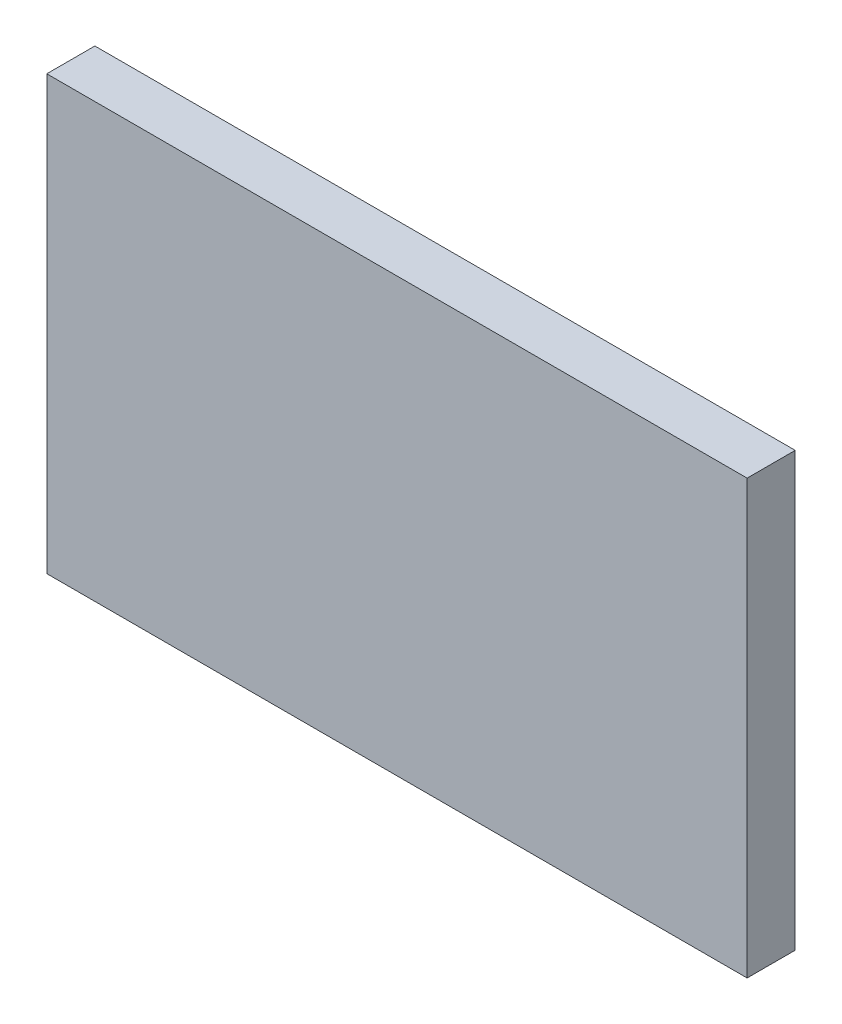
ISO-10303-21;
HEADER;
FILE_DESCRIPTION(('STEP AP214'),'2;1');
FILE_NAME('part.step','',(''),(''),'','','');
FILE_SCHEMA(('AUTOMOTIVE_DESIGN { 1 0 10303 214 1 1 1 1 }'));
ENDSEC;
DATA;
#1=APPLICATION_CONTEXT('core data for automotive mechanical design processes');
#2=APPLICATION_PROTOCOL_DEFINITION('international standard','automotive_design',2000,#1);
#3=PRODUCT_CONTEXT('',#1,'mechanical');
#4=PRODUCT('Part','Part','',(#3));
#5=PRODUCT_RELATED_PRODUCT_CATEGORY('part','',(#4));
#6=PRODUCT_DEFINITION_FORMATION('','',#4);
#7=PRODUCT_DEFINITION_CONTEXT('part definition',#1,'design');
#8=PRODUCT_DEFINITION('design','',#6,#7);
#9=PRODUCT_DEFINITION_SHAPE('','',#8);
#10=(LENGTH_UNIT() NAMED_UNIT(*) SI_UNIT(.MILLI.,.METRE.));
#11=(NAMED_UNIT(*) PLANE_ANGLE_UNIT() SI_UNIT($,.RADIAN.));
#12=(NAMED_UNIT(*) SI_UNIT($,.STERADIAN.) SOLID_ANGLE_UNIT());
#13=UNCERTAINTY_MEASURE_WITH_UNIT(LENGTH_MEASURE(1.E-05),#10,'distance_accuracy_value','');
#14=(GEOMETRIC_REPRESENTATION_CONTEXT(3) GLOBAL_UNCERTAINTY_ASSIGNED_CONTEXT((#13)) GLOBAL_UNIT_ASSIGNED_CONTEXT((#10,
#11,#12)) REPRESENTATION_CONTEXT('',''));
#15=CARTESIAN_POINT('',(0.,0.,0.));
#16=DIRECTION('',(0.,0.,1.));
#17=DIRECTION('',(1.,0.,0.));
#18=AXIS2_PLACEMENT_3D('',#15,#16,#17);
#19=CARTESIAN_POINT('',(23.114,-14.2875,3.175));
#20=DIRECTION('',(-1.,0.,0.));
#21=DIRECTION('',(0.,0.,1.));
#22=AXIS2_PLACEMENT_3D('',#19,#20,#21);
#23=PLANE('',#22);
#24=DIRECTION('',(0.,1.,0.));
#25=VECTOR('',#24,1.);
#26=CARTESIAN_POINT('',(23.114,-14.2875,0.));
#27=LINE('',#26,#25);
#28=CARTESIAN_POINT('',(23.114,-14.2875,0.));
#29=VERTEX_POINT('',#28);
#30=CARTESIAN_POINT('',(23.114,14.2875,0.));
#31=VERTEX_POINT('',#30);
#32=EDGE_CURVE('E98',#29,#31,#27,.T.);
#33=ORIENTED_EDGE('',*,*,#32,.T.);
#34=DIRECTION('',(0.,0.,-1.));
#35=VECTOR('',#34,1.);
#36=CARTESIAN_POINT('',(23.114,14.2875,3.175));
#37=LINE('',#36,#35);
#38=CARTESIAN_POINT('',(23.114,14.2875,3.175));
#39=VERTEX_POINT('',#38);
#40=EDGE_CURVE('E11',#39,#31,#37,.T.);
#41=ORIENTED_EDGE('',*,*,#40,.F.);
#42=DIRECTION('',(0.,1.,0.));
#43=VECTOR('',#42,1.);
#44=CARTESIAN_POINT('',(23.114,-14.2875,3.175));
#45=LINE('',#44,#43);
#46=CARTESIAN_POINT('',(23.114,-14.2875,3.175));
#47=VERTEX_POINT('',#46);
#48=EDGE_CURVE('E86',#47,#39,#45,.T.);
#49=ORIENTED_EDGE('',*,*,#48,.F.);
#50=DIRECTION('',(0.,0.,-1.));
#51=VECTOR('',#50,1.);
#52=CARTESIAN_POINT('',(23.114,-14.2875,3.175));
#53=LINE('',#52,#51);
#54=EDGE_CURVE('E94',#47,#29,#53,.T.);
#55=ORIENTED_EDGE('',*,*,#54,.T.);
#56=EDGE_LOOP('',(#33,#41,#49,#55));
#57=FACE_BOUND('',#56,.T.);
#58=ADVANCED_FACE('F35',(#57),#23,.F.);
#59=CARTESIAN_POINT('',(-23.114,14.2875,3.175));
#60=DIRECTION('',(0.,-1.,0.));
#61=DIRECTION('',(0.,0.,-1.));
#62=AXIS2_PLACEMENT_3D('',#59,#60,#61);
#63=PLANE('',#62);
#64=DIRECTION('',(-1.,0.,0.));
#65=VECTOR('',#64,1.);
#66=CARTESIAN_POINT('',(-23.114,14.2875,0.));
#67=LINE('',#66,#65);
#68=CARTESIAN_POINT('',(-23.114,14.2875,0.));
#69=VERTEX_POINT('',#68);
#70=EDGE_CURVE('E90',#31,#69,#67,.T.);
#71=ORIENTED_EDGE('',*,*,#70,.T.);
#72=DIRECTION('',(0.,0.,-1.));
#73=VECTOR('',#72,1.);
#74=CARTESIAN_POINT('',(-23.114,14.2875,3.175));
#75=LINE('',#74,#73);
#76=CARTESIAN_POINT('',(-23.114,14.2875,3.175));
#77=VERTEX_POINT('',#76);
#78=EDGE_CURVE('E43',#77,#69,#75,.T.);
#79=ORIENTED_EDGE('',*,*,#78,.F.);
#80=DIRECTION('',(-1.,0.,0.));
#81=VECTOR('',#80,1.);
#82=CARTESIAN_POINT('',(-23.114,14.2875,3.175));
#83=LINE('',#82,#81);
#84=EDGE_CURVE('E81',#39,#77,#83,.T.);
#85=ORIENTED_EDGE('',*,*,#84,.F.);
#86=ORIENTED_EDGE('',*,*,#40,.T.);
#87=EDGE_LOOP('',(#71,#79,#85,#86));
#88=FACE_BOUND('',#87,.T.);
#89=ADVANCED_FACE('F89',(#88),#63,.F.);
#90=CARTESIAN_POINT('',(-23.114,-14.2875,3.175));
#91=DIRECTION('',(1.,0.,0.));
#92=DIRECTION('',(0.,0.,-1.));
#93=AXIS2_PLACEMENT_3D('',#90,#91,#92);
#94=PLANE('',#93);
#95=DIRECTION('',(0.,-1.,0.));
#96=VECTOR('',#95,1.);
#97=CARTESIAN_POINT('',(-23.114,-14.2875,0.));
#98=LINE('',#97,#96);
#99=CARTESIAN_POINT('',(-23.114,-14.2875,0.));
#100=VERTEX_POINT('',#99);
#101=EDGE_CURVE('E68',#69,#100,#98,.T.);
#102=ORIENTED_EDGE('',*,*,#101,.T.);
#103=DIRECTION('',(0.,0.,-1.));
#104=VECTOR('',#103,1.);
#105=CARTESIAN_POINT('',(-23.114,-14.2875,3.175));
#106=LINE('',#105,#104);
#107=CARTESIAN_POINT('',(-23.114,-14.2875,3.175));
#108=VERTEX_POINT('',#107);
#109=EDGE_CURVE('E91',#108,#100,#106,.T.);
#110=ORIENTED_EDGE('',*,*,#109,.F.);
#111=DIRECTION('',(0.,-1.,0.));
#112=VECTOR('',#111,1.);
#113=CARTESIAN_POINT('',(-23.114,-14.2875,3.175));
#114=LINE('',#113,#112);
#115=EDGE_CURVE('E84',#77,#108,#114,.T.);
#116=ORIENTED_EDGE('',*,*,#115,.F.);
#117=ORIENTED_EDGE('',*,*,#78,.T.);
#118=EDGE_LOOP('',(#102,#110,#116,#117));
#119=FACE_BOUND('',#118,.T.);
#120=ADVANCED_FACE('F92',(#119),#94,.F.);
#121=CARTESIAN_POINT('',(-23.114,-14.2875,3.175));
#122=DIRECTION('',(0.,1.,0.));
#123=DIRECTION('',(0.,0.,1.));
#124=AXIS2_PLACEMENT_3D('',#121,#122,#123);
#125=PLANE('',#124);
#126=DIRECTION('',(1.,0.,0.));
#127=VECTOR('',#126,1.);
#128=CARTESIAN_POINT('',(-23.114,-14.2875,0.));
#129=LINE('',#128,#127);
#130=EDGE_CURVE('E74',#100,#29,#129,.T.);
#131=ORIENTED_EDGE('',*,*,#130,.T.);
#132=ORIENTED_EDGE('',*,*,#54,.F.);
#133=DIRECTION('',(1.,0.,0.));
#134=VECTOR('',#133,1.);
#135=CARTESIAN_POINT('',(-23.114,-14.2875,3.175));
#136=LINE('',#135,#134);
#137=EDGE_CURVE('E51',#108,#47,#136,.T.);
#138=ORIENTED_EDGE('',*,*,#137,.F.);
#139=ORIENTED_EDGE('',*,*,#109,.T.);
#140=EDGE_LOOP('',(#131,#132,#138,#139));
#141=FACE_BOUND('',#140,.T.);
#142=ADVANCED_FACE('F105',(#141),#125,.F.);
#143=CARTESIAN_POINT('',(0.,0.,3.175));
#144=DIRECTION('',(0.,0.,-1.));
#145=DIRECTION('',(-1.,0.,0.));
#146=AXIS2_PLACEMENT_3D('',#143,#144,#145);
#147=PLANE('',#146);
#148=ORIENTED_EDGE('',*,*,#48,.T.);
#149=ORIENTED_EDGE('',*,*,#84,.T.);
#150=ORIENTED_EDGE('',*,*,#115,.T.);
#151=ORIENTED_EDGE('',*,*,#137,.T.);
#152=EDGE_LOOP('',(#148,#149,#150,#151));
#153=FACE_BOUND('',#152,.T.);
#154=ADVANCED_FACE('F82',(#153),#147,.F.);
#155=CARTESIAN_POINT('',(0.,0.,0.));
#156=DIRECTION('',(0.,0.,-1.));
#157=DIRECTION('',(-1.,0.,0.));
#158=AXIS2_PLACEMENT_3D('',#155,#156,#157);
#159=PLANE('',#158);
#160=ORIENTED_EDGE('',*,*,#32,.F.);
#161=ORIENTED_EDGE('',*,*,#130,.F.);
#162=ORIENTED_EDGE('',*,*,#101,.F.);
#163=ORIENTED_EDGE('',*,*,#70,.F.);
#164=EDGE_LOOP('',(#160,#161,#162,#163));
#165=FACE_BOUND('',#164,.T.);
#166=ADVANCED_FACE('F108',(#165),#159,.T.);
#167=CLOSED_SHELL('',(#58,#89,#120,#142,#154,#166));
#168=MANIFOLD_SOLID_BREP('B2',#167);
#169=ADVANCED_BREP_SHAPE_REPRESENTATION('',(#18,#168),#14);
#170=SHAPE_DEFINITION_REPRESENTATION(#9,#169);
ENDSEC;
END-ISO-10303-21;
